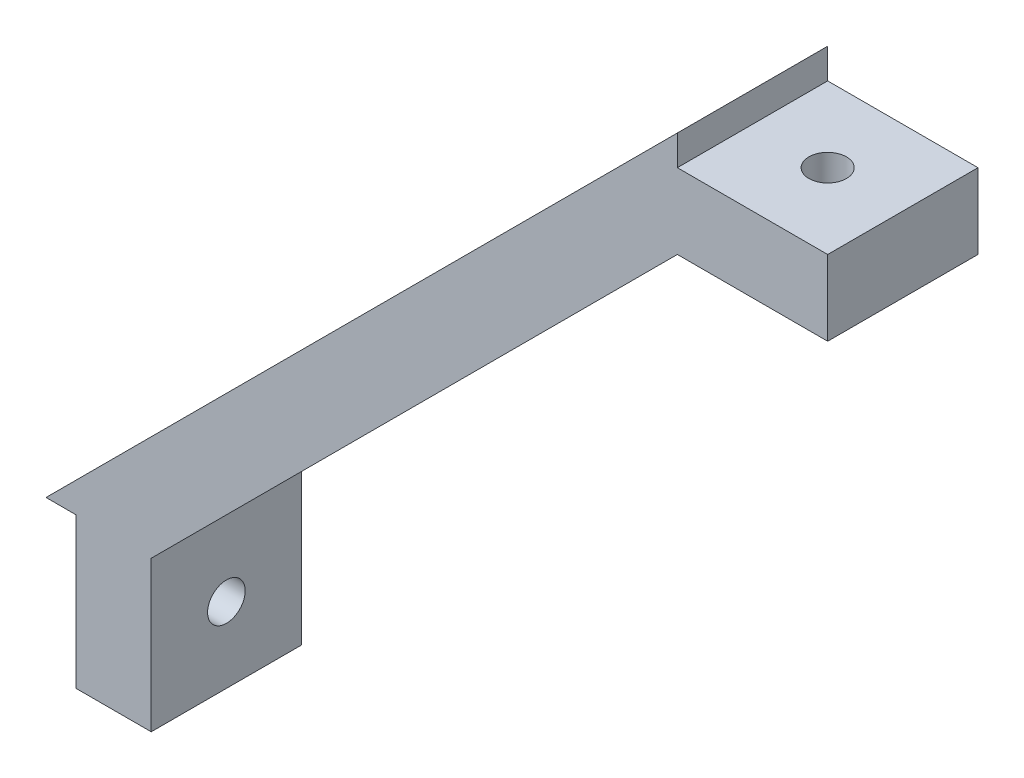
ISO-10303-21;
HEADER;
FILE_DESCRIPTION(('STEP AP214'),'2;1');
FILE_NAME('part.step','',(''),(''),'','','');
FILE_SCHEMA(('AUTOMOTIVE_DESIGN { 1 0 10303 214 1 1 1 1 }'));
ENDSEC;
DATA;
#1=APPLICATION_CONTEXT('core data for automotive mechanical design processes');
#2=APPLICATION_PROTOCOL_DEFINITION('international standard','automotive_design',2000,#1);
#3=PRODUCT_CONTEXT('',#1,'mechanical');
#4=PRODUCT('Part','Part','',(#3));
#5=PRODUCT_RELATED_PRODUCT_CATEGORY('part','',(#4));
#6=PRODUCT_DEFINITION_FORMATION('','',#4);
#7=PRODUCT_DEFINITION_CONTEXT('part definition',#1,'design');
#8=PRODUCT_DEFINITION('design','',#6,#7);
#9=PRODUCT_DEFINITION_SHAPE('','',#8);
#10=(LENGTH_UNIT() NAMED_UNIT(*) SI_UNIT(.MILLI.,.METRE.));
#11=(NAMED_UNIT(*) PLANE_ANGLE_UNIT() SI_UNIT($,.RADIAN.));
#12=(NAMED_UNIT(*) SI_UNIT($,.STERADIAN.) SOLID_ANGLE_UNIT());
#13=UNCERTAINTY_MEASURE_WITH_UNIT(LENGTH_MEASURE(1.E-05),#10,'distance_accuracy_value','');
#14=(GEOMETRIC_REPRESENTATION_CONTEXT(3) GLOBAL_UNCERTAINTY_ASSIGNED_CONTEXT((#13)) GLOBAL_UNIT_ASSIGNED_CONTEXT((#10,
#11,#12)) REPRESENTATION_CONTEXT('',''));
#15=CARTESIAN_POINT('',(0.,0.,0.));
#16=DIRECTION('',(0.,0.,1.));
#17=DIRECTION('',(1.,0.,0.));
#18=AXIS2_PLACEMENT_3D('',#15,#16,#17);
#19=CARTESIAN_POINT('',(-35.142135623731,6.85786437626901,0.));
#20=DIRECTION('',(0.707106781186549,-0.707106781186546,0.));
#21=DIRECTION('',(0.707106781186546,0.707106781186549,0.));
#22=AXIS2_PLACEMENT_3D('',#19,#20,#21);
#23=CYLINDRICAL_SURFACE('',#22,1.25);
#24=CARTESIAN_POINT('',(-10.6421356237309,-17.642135623731,0.));
#25=DIRECTION('',(-0.707106781186549,0.707106781186546,0.));
#26=DIRECTION('',(-0.707106781186546,-0.707106781186549,0.));
#27=AXIS2_PLACEMENT_3D('',#24,#25,#26);
#28=CIRCLE('',#27,1.25);
#29=CARTESIAN_POINT('',(-11.5260191002141,-18.5260191002142,0.));
#30=VERTEX_POINT('',#29);
#31=EDGE_CURVE('E43',#30,#30,#28,.T.);
#32=ORIENTED_EDGE('',*,*,#31,.F.);
#33=EDGE_LOOP('',(#32));
#34=FACE_BOUND('',#33,.T.);
#35=CARTESIAN_POINT('',(-14.1421356237309,-14.142135623731,0.));
#36=DIRECTION('',(0.707106781186549,-0.707106781186546,0.));
#37=DIRECTION('',(0.707106781186546,0.707106781186549,0.));
#38=AXIS2_PLACEMENT_3D('',#35,#36,#37);
#39=CIRCLE('',#38,1.25);
#40=CARTESIAN_POINT('',(-13.2582521472477,-13.2582521472478,0.));
#41=VERTEX_POINT('',#40);
#42=EDGE_CURVE('E11',#41,#41,#39,.F.);
#43=ORIENTED_EDGE('',*,*,#42,.T.);
#44=EDGE_LOOP('',(#43));
#45=FACE_BOUND('',#44,.T.);
#46=ADVANCED_FACE('F35',(#34,#45),#23,.F.);
#47=CARTESIAN_POINT('',(-28.0710678118655,13.9289321881345,0.));
#48=DIRECTION('',(0.707106781186549,-0.707106781186546,0.));
#49=DIRECTION('',(0.707106781186546,0.707106781186549,0.));
#50=AXIS2_PLACEMENT_3D('',#47,#48,#49);
#51=CYLINDRICAL_SURFACE('',#50,1.25);
#52=CARTESIAN_POINT('',(-3.57106781186546,-10.5710678118655,0.));
#53=DIRECTION('',(-0.707106781186549,0.707106781186546,0.));
#54=DIRECTION('',(-0.707106781186546,-0.707106781186549,0.));
#55=AXIS2_PLACEMENT_3D('',#52,#53,#54);
#56=CIRCLE('',#55,1.25);
#57=CARTESIAN_POINT('',(-4.45495128834864,-11.4549512883487,0.));
#58=VERTEX_POINT('',#57);
#59=EDGE_CURVE('E201',#58,#58,#56,.T.);
#60=ORIENTED_EDGE('',*,*,#59,.F.);
#61=EDGE_LOOP('',(#60));
#62=FACE_BOUND('',#61,.T.);
#63=CARTESIAN_POINT('',(-7.07106781186546,-7.07106781186549,0.));
#64=DIRECTION('',(0.707106781186549,-0.707106781186546,0.));
#65=DIRECTION('',(0.707106781186546,0.707106781186549,0.));
#66=AXIS2_PLACEMENT_3D('',#63,#64,#65);
#67=CIRCLE('',#66,1.25);
#68=CARTESIAN_POINT('',(-6.18718433538228,-6.1871843353823,0.));
#69=VERTEX_POINT('',#68);
#70=EDGE_CURVE('E204',#69,#69,#67,.F.);
#71=ORIENTED_EDGE('',*,*,#70,.T.);
#72=EDGE_LOOP('',(#71));
#73=FACE_BOUND('',#72,.T.);
#74=ADVANCED_FACE('F213',(#62,#73),#51,.F.);
#75=CARTESIAN_POINT('',(-21.0000000000001,21.,0.));
#76=DIRECTION('',(0.707106781186549,-0.707106781186546,0.));
#77=DIRECTION('',(0.707106781186546,0.707106781186549,0.));
#78=AXIS2_PLACEMENT_3D('',#75,#76,#77);
#79=CYLINDRICAL_SURFACE('',#78,1.25);
#80=CARTESIAN_POINT('',(3.5,-3.49999999999999,0.));
#81=DIRECTION('',(-0.707106781186549,0.707106781186546,0.));
#82=DIRECTION('',(-0.707106781186546,-0.707106781186549,0.));
#83=AXIS2_PLACEMENT_3D('',#80,#81,#82);
#84=CIRCLE('',#83,1.25);
#85=CARTESIAN_POINT('',(2.61611652351682,-4.38388347648317,0.));
#86=VERTEX_POINT('',#85);
#87=EDGE_CURVE('E184',#86,#86,#84,.T.);
#88=ORIENTED_EDGE('',*,*,#87,.F.);
#89=EDGE_LOOP('',(#88));
#90=FACE_BOUND('',#89,.T.);
#91=CARTESIAN_POINT('',(0.,0.,0.));
#92=DIRECTION('',(0.707106781186549,-0.707106781186546,0.));
#93=DIRECTION('',(0.707106781186546,0.707106781186549,0.));
#94=AXIS2_PLACEMENT_3D('',#91,#92,#93);
#95=CIRCLE('',#94,1.25);
#96=CARTESIAN_POINT('',(0.883883476483178,0.88388347648319,0.));
#97=VERTEX_POINT('',#96);
#98=EDGE_CURVE('E198',#97,#97,#95,.F.);
#99=ORIENTED_EDGE('',*,*,#98,.T.);
#100=EDGE_LOOP('',(#99));
#101=FACE_BOUND('',#100,.T.);
#102=ADVANCED_FACE('F260',(#90,#101),#79,.F.);
#103=CARTESIAN_POINT('',(-21.,-21.0000000000001,5.));
#104=DIRECTION('',(0.,1.,0.));
#105=DIRECTION('',(0.,0.,1.));
#106=AXIS2_PLACEMENT_3D('',#103,#104,#105);
#107=PLANE('',#106);
#108=DIRECTION('',(1.,0.,0.));
#109=VECTOR('',#108,1.);
#110=CARTESIAN_POINT('',(-21.,-21.0000000000001,-5.));
#111=LINE('',#110,#109);
#112=CARTESIAN_POINT('',(-21.,-21.0000000000001,-5.));
#113=VERTEX_POINT('',#112);
#114=CARTESIAN_POINT('',(-19.,-21.0000000000001,-5.));
#115=VERTEX_POINT('',#114);
#116=EDGE_CURVE('E144',#113,#115,#111,.T.);
#117=ORIENTED_EDGE('',*,*,#116,.T.);
#118=DIRECTION('',(0.,0.,-1.));
#119=VECTOR('',#118,1.);
#120=CARTESIAN_POINT('',(-19.,-21.0000000000001,5.));
#121=LINE('',#120,#119);
#122=CARTESIAN_POINT('',(-19.,-21.0000000000001,5.));
#123=VERTEX_POINT('',#122);
#124=EDGE_CURVE('E182',#123,#115,#121,.T.);
#125=ORIENTED_EDGE('',*,*,#124,.F.);
#126=DIRECTION('',(1.,0.,0.));
#127=VECTOR('',#126,1.);
#128=CARTESIAN_POINT('',(-21.,-21.0000000000001,5.));
#129=LINE('',#128,#127);
#130=CARTESIAN_POINT('',(-21.,-21.0000000000001,5.));
#131=VERTEX_POINT('',#130);
#132=EDGE_CURVE('E163',#131,#123,#129,.T.);
#133=ORIENTED_EDGE('',*,*,#132,.F.);
#134=DIRECTION('',(0.,0.,-1.));
#135=VECTOR('',#134,1.);
#136=CARTESIAN_POINT('',(-21.,-21.0000000000001,5.));
#137=LINE('',#136,#135);
#138=EDGE_CURVE('E140',#131,#113,#137,.T.);
#139=ORIENTED_EDGE('',*,*,#138,.T.);
#140=EDGE_LOOP('',(#117,#125,#133,#139));
#141=FACE_BOUND('',#140,.T.);
#142=ADVANCED_FACE('F256',(#141),#107,.F.);
#143=CARTESIAN_POINT('',(-19.,-21.0000000000001,5.));
#144=DIRECTION('',(1.,0.,0.));
#145=DIRECTION('',(0.,1.,0.));
#146=AXIS2_PLACEMENT_3D('',#143,#144,#145);
#147=PLANE('',#146);
#148=CARTESIAN_POINT('',(-19.,-26.0000000000001,0.));
#149=DIRECTION('',(1.,0.,0.));
#150=DIRECTION('',(0.,1.,0.));
#151=AXIS2_PLACEMENT_3D('',#148,#149,#150);
#152=CIRCLE('',#151,1.25);
#153=CARTESIAN_POINT('',(-19.,-24.7500000000001,0.));
#154=VERTEX_POINT('',#153);
#155=EDGE_CURVE('E148',#154,#154,#152,.T.);
#156=ORIENTED_EDGE('',*,*,#155,.T.);
#157=EDGE_LOOP('',(#156));
#158=FACE_BOUND('',#157,.T.);
#159=DIRECTION('',(0.,-1.,0.));
#160=VECTOR('',#159,1.);
#161=CARTESIAN_POINT('',(-19.,-21.0000000000001,-5.));
#162=LINE('',#161,#160);
#163=CARTESIAN_POINT('',(-19.,-31.0000000000001,-5.));
#164=VERTEX_POINT('',#163);
#165=EDGE_CURVE('E147',#115,#164,#162,.T.);
#166=ORIENTED_EDGE('',*,*,#165,.T.);
#167=DIRECTION('',(0.,0.,-1.));
#168=VECTOR('',#167,1.);
#169=CARTESIAN_POINT('',(-19.,-31.0000000000001,5.));
#170=LINE('',#169,#168);
#171=CARTESIAN_POINT('',(-19.,-31.0000000000001,5.));
#172=VERTEX_POINT('',#171);
#173=EDGE_CURVE('E179',#172,#164,#170,.T.);
#174=ORIENTED_EDGE('',*,*,#173,.F.);
#175=DIRECTION('',(0.,-1.,0.));
#176=VECTOR('',#175,1.);
#177=CARTESIAN_POINT('',(-19.,-21.0000000000001,5.));
#178=LINE('',#177,#176);
#179=EDGE_CURVE('E101',#123,#172,#178,.T.);
#180=ORIENTED_EDGE('',*,*,#179,.F.);
#181=ORIENTED_EDGE('',*,*,#124,.T.);
#182=EDGE_LOOP('',(#166,#174,#180,#181));
#183=FACE_BOUND('',#182,.T.);
#184=ADVANCED_FACE('F252',(#158,#183),#147,.F.);
#185=CARTESIAN_POINT('',(-19.,-31.0000000000001,5.));
#186=DIRECTION('',(0.,1.,0.));
#187=DIRECTION('',(0.,0.,1.));
#188=AXIS2_PLACEMENT_3D('',#185,#186,#187);
#189=PLANE('',#188);
#190=DIRECTION('',(1.,0.,0.));
#191=VECTOR('',#190,1.);
#192=CARTESIAN_POINT('',(-19.,-31.0000000000001,-5.));
#193=LINE('',#192,#191);
#194=CARTESIAN_POINT('',(-14.,-31.0000000000001,-5.));
#195=VERTEX_POINT('',#194);
#196=EDGE_CURVE('E150',#164,#195,#193,.T.);
#197=ORIENTED_EDGE('',*,*,#196,.T.);
#198=DIRECTION('',(0.,0.,-1.));
#199=VECTOR('',#198,1.);
#200=CARTESIAN_POINT('',(-14.,-31.0000000000001,5.));
#201=LINE('',#200,#199);
#202=CARTESIAN_POINT('',(-14.,-31.0000000000001,5.));
#203=VERTEX_POINT('',#202);
#204=EDGE_CURVE('E176',#203,#195,#201,.T.);
#205=ORIENTED_EDGE('',*,*,#204,.F.);
#206=DIRECTION('',(1.,0.,0.));
#207=VECTOR('',#206,1.);
#208=CARTESIAN_POINT('',(-19.,-31.0000000000001,5.));
#209=LINE('',#208,#207);
#210=EDGE_CURVE('E402',#172,#203,#209,.T.);
#211=ORIENTED_EDGE('',*,*,#210,.F.);
#212=ORIENTED_EDGE('',*,*,#173,.T.);
#213=EDGE_LOOP('',(#197,#205,#211,#212));
#214=FACE_BOUND('',#213,.T.);
#215=ADVANCED_FACE('F248',(#214),#189,.F.);
#216=CARTESIAN_POINT('',(-14.,-31.0000000000001,5.));
#217=DIRECTION('',(-1.,0.,0.));
#218=DIRECTION('',(0.,-1.,0.));
#219=AXIS2_PLACEMENT_3D('',#216,#217,#218);
#220=PLANE('',#219);
#221=CARTESIAN_POINT('',(-14.,-26.0000000000001,0.));
#222=DIRECTION('',(-1.,0.,0.));
#223=DIRECTION('',(0.,-1.,0.));
#224=AXIS2_PLACEMENT_3D('',#221,#222,#223);
#225=CIRCLE('',#224,1.25);
#226=CARTESIAN_POINT('',(-14.,-27.2500000000001,0.));
#227=VERTEX_POINT('',#226);
#228=EDGE_CURVE('E185',#227,#227,#225,.T.);
#229=ORIENTED_EDGE('',*,*,#228,.T.);
#230=EDGE_LOOP('',(#229));
#231=FACE_BOUND('',#230,.T.);
#232=DIRECTION('',(0.,1.,0.));
#233=VECTOR('',#232,1.);
#234=CARTESIAN_POINT('',(-14.,-31.0000000000001,-5.));
#235=LINE('',#234,#233);
#236=CARTESIAN_POINT('',(-14.,-21.0000000000001,-5.));
#237=VERTEX_POINT('',#236);
#238=EDGE_CURVE('E152',#195,#237,#235,.T.);
#239=ORIENTED_EDGE('',*,*,#238,.T.);
#240=DIRECTION('',(0.,0.,-1.));
#241=VECTOR('',#240,1.);
#242=CARTESIAN_POINT('',(-14.,-21.0000000000001,5.));
#243=LINE('',#242,#241);
#244=CARTESIAN_POINT('',(-14.,-21.0000000000001,5.));
#245=VERTEX_POINT('',#244);
#246=EDGE_CURVE('E173',#245,#237,#243,.T.);
#247=ORIENTED_EDGE('',*,*,#246,.F.);
#248=DIRECTION('',(0.,1.,0.));
#249=VECTOR('',#248,1.);
#250=CARTESIAN_POINT('',(-14.,-31.0000000000001,5.));
#251=LINE('',#250,#249);
#252=EDGE_CURVE('E404',#203,#245,#251,.T.);
#253=ORIENTED_EDGE('',*,*,#252,.F.);
#254=ORIENTED_EDGE('',*,*,#204,.T.);
#255=EDGE_LOOP('',(#239,#247,#253,#254));
#256=FACE_BOUND('',#255,.T.);
#257=ADVANCED_FACE('F244',(#231,#256),#220,.F.);
#258=CARTESIAN_POINT('',(-14.,-21.0000000000001,5.));
#259=DIRECTION('',(-0.707106781186549,0.707106781186546,0.));
#260=DIRECTION('',(-0.707106781186546,-0.707106781186549,0.));
#261=AXIS2_PLACEMENT_3D('',#258,#259,#260);
#262=PLANE('',#261);
#263=CARTESIAN_POINT('',(10.5710678118655,3.5710678118655,0.));
#264=DIRECTION('',(-0.707106781186549,0.707106781186546,0.));
#265=DIRECTION('',(-0.707106781186546,-0.707106781186549,0.));
#266=AXIS2_PLACEMENT_3D('',#263,#264,#265);
#267=CIRCLE('',#266,1.25);
#268=CARTESIAN_POINT('',(9.68718433538228,2.68718433538232,0.));
#269=VERTEX_POINT('',#268);
#270=EDGE_CURVE('E388',#269,#269,#267,.T.);
#271=ORIENTED_EDGE('',*,*,#270,.T.);
#272=EDGE_LOOP('',(#271));
#273=FACE_BOUND('',#272,.T.);
#274=CARTESIAN_POINT('',(17.6421356237309,10.642135623731,0.));
#275=DIRECTION('',(-0.707106781186549,0.707106781186546,0.));
#276=DIRECTION('',(-0.707106781186546,-0.707106781186549,0.));
#277=AXIS2_PLACEMENT_3D('',#274,#275,#276);
#278=CIRCLE('',#277,1.25);
#279=CARTESIAN_POINT('',(16.7582521472477,9.75825214724781,0.));
#280=VERTEX_POINT('',#279);
#281=EDGE_CURVE('E195',#280,#280,#278,.T.);
#282=ORIENTED_EDGE('',*,*,#281,.T.);
#283=EDGE_LOOP('',(#282));
#284=FACE_BOUND('',#283,.T.);
#285=DIRECTION('',(0.707106781186546,0.707106781186549,0.));
#286=VECTOR('',#285,1.);
#287=CARTESIAN_POINT('',(-14.,-21.0000000000001,-5.));
#288=LINE('',#287,#286);
#289=CARTESIAN_POINT('',(21.,14.0000000000001,-5.));
#290=VERTEX_POINT('',#289);
#291=EDGE_CURVE('E154',#237,#290,#288,.T.);
#292=ORIENTED_EDGE('',*,*,#291,.T.);
#293=DIRECTION('',(0.,0.,-1.));
#294=VECTOR('',#293,1.);
#295=CARTESIAN_POINT('',(21.,14.0000000000001,5.));
#296=LINE('',#295,#294);
#297=CARTESIAN_POINT('',(21.,14.0000000000001,5.));
#298=VERTEX_POINT('',#297);
#299=EDGE_CURVE('E170',#298,#290,#296,.T.);
#300=ORIENTED_EDGE('',*,*,#299,.F.);
#301=DIRECTION('',(0.707106781186546,0.707106781186549,0.));
#302=VECTOR('',#301,1.);
#303=CARTESIAN_POINT('',(-14.,-21.0000000000001,5.));
#304=LINE('',#303,#302);
#305=EDGE_CURVE('E406',#245,#298,#304,.T.);
#306=ORIENTED_EDGE('',*,*,#305,.F.);
#307=ORIENTED_EDGE('',*,*,#246,.T.);
#308=EDGE_LOOP('',(#292,#300,#306,#307));
#309=FACE_BOUND('',#308,.T.);
#310=ORIENTED_EDGE('',*,*,#87,.T.);
#311=EDGE_LOOP('',(#310));
#312=FACE_BOUND('',#311,.T.);
#313=ORIENTED_EDGE('',*,*,#59,.T.);
#314=EDGE_LOOP('',(#313));
#315=FACE_BOUND('',#314,.T.);
#316=ORIENTED_EDGE('',*,*,#31,.T.);
#317=EDGE_LOOP('',(#316));
#318=FACE_BOUND('',#317,.T.);
#319=ADVANCED_FACE('F209',(#273,#284,#309,#312,#315,#318),#262,.F.);
#320=CARTESIAN_POINT('',(21.,14.0000000000001,5.));
#321=DIRECTION('',(0.,1.,0.));
#322=DIRECTION('',(0.,0.,1.));
#323=AXIS2_PLACEMENT_3D('',#320,#321,#322);
#324=PLANE('',#323);
#325=CARTESIAN_POINT('',(26.,14.0000000000001,0.));
#326=DIRECTION('',(0.,1.,0.));
#327=DIRECTION('',(0.,0.,1.));
#328=AXIS2_PLACEMENT_3D('',#325,#326,#327);
#329=CIRCLE('',#328,1.25);
#330=CARTESIAN_POINT('',(26.,14.0000000000001,1.25));
#331=VERTEX_POINT('',#330);
#332=EDGE_CURVE('E188',#331,#331,#329,.T.);
#333=ORIENTED_EDGE('',*,*,#332,.T.);
#334=EDGE_LOOP('',(#333));
#335=FACE_BOUND('',#334,.T.);
#336=DIRECTION('',(1.,0.,0.));
#337=VECTOR('',#336,1.);
#338=CARTESIAN_POINT('',(21.,14.0000000000001,-5.));
#339=LINE('',#338,#337);
#340=CARTESIAN_POINT('',(31.,14.0000000000001,-5.));
#341=VERTEX_POINT('',#340);
#342=EDGE_CURVE('E156',#290,#341,#339,.T.);
#343=ORIENTED_EDGE('',*,*,#342,.T.);
#344=DIRECTION('',(0.,0.,-1.));
#345=VECTOR('',#344,1.);
#346=CARTESIAN_POINT('',(31.,14.0000000000001,5.));
#347=LINE('',#346,#345);
#348=CARTESIAN_POINT('',(31.,14.0000000000001,5.));
#349=VERTEX_POINT('',#348);
#350=EDGE_CURVE('E167',#349,#341,#347,.T.);
#351=ORIENTED_EDGE('',*,*,#350,.F.);
#352=DIRECTION('',(1.,0.,0.));
#353=VECTOR('',#352,1.);
#354=CARTESIAN_POINT('',(21.,14.0000000000001,5.));
#355=LINE('',#354,#353);
#356=EDGE_CURVE('E408',#298,#349,#355,.T.);
#357=ORIENTED_EDGE('',*,*,#356,.F.);
#358=ORIENTED_EDGE('',*,*,#299,.T.);
#359=EDGE_LOOP('',(#343,#351,#357,#358));
#360=FACE_BOUND('',#359,.T.);
#361=ADVANCED_FACE('F237',(#335,#360),#324,.F.);
#362=CARTESIAN_POINT('',(31.,19.0000000000001,5.));
#363=DIRECTION('',(-1.,0.,0.));
#364=DIRECTION('',(0.,-1.,0.));
#365=AXIS2_PLACEMENT_3D('',#362,#363,#364);
#366=PLANE('',#365);
#367=DIRECTION('',(0.,1.,0.));
#368=VECTOR('',#367,1.);
#369=CARTESIAN_POINT('',(31.,19.0000000000001,-5.));
#370=LINE('',#369,#368);
#371=CARTESIAN_POINT('',(31.,19.0000000000001,-5.));
#372=VERTEX_POINT('',#371);
#373=EDGE_CURVE('E158',#341,#372,#370,.T.);
#374=ORIENTED_EDGE('',*,*,#373,.T.);
#375=DIRECTION('',(0.,0.,-1.));
#376=VECTOR('',#375,1.);
#377=CARTESIAN_POINT('',(31.,19.0000000000001,5.));
#378=LINE('',#377,#376);
#379=CARTESIAN_POINT('',(31.,19.0000000000001,5.));
#380=VERTEX_POINT('',#379);
#381=EDGE_CURVE('E135',#380,#372,#378,.T.);
#382=ORIENTED_EDGE('',*,*,#381,.F.);
#383=DIRECTION('',(0.,1.,0.));
#384=VECTOR('',#383,1.);
#385=CARTESIAN_POINT('',(31.,19.0000000000001,5.));
#386=LINE('',#385,#384);
#387=EDGE_CURVE('E126',#349,#380,#386,.T.);
#388=ORIENTED_EDGE('',*,*,#387,.F.);
#389=ORIENTED_EDGE('',*,*,#350,.T.);
#390=EDGE_LOOP('',(#374,#382,#388,#389));
#391=FACE_BOUND('',#390,.T.);
#392=ADVANCED_FACE('F233',(#391),#366,.F.);
#393=CARTESIAN_POINT('',(21.,19.0000000000001,5.));
#394=DIRECTION('',(0.,-1.,0.));
#395=DIRECTION('',(1.,0.,0.));
#396=AXIS2_PLACEMENT_3D('',#393,#394,#395);
#397=PLANE('',#396);
#398=CARTESIAN_POINT('',(26.,19.0000000000001,0.));
#399=DIRECTION('',(0.,-1.,0.));
#400=DIRECTION('',(1.,0.,0.));
#401=AXIS2_PLACEMENT_3D('',#398,#399,#400);
#402=CIRCLE('',#401,1.25);
#403=CARTESIAN_POINT('',(27.25,19.0000000000001,0.));
#404=VERTEX_POINT('',#403);
#405=EDGE_CURVE('E189',#404,#404,#402,.T.);
#406=ORIENTED_EDGE('',*,*,#405,.T.);
#407=EDGE_LOOP('',(#406));
#408=FACE_BOUND('',#407,.T.);
#409=DIRECTION('',(-1.,0.,0.));
#410=VECTOR('',#409,1.);
#411=CARTESIAN_POINT('',(21.,19.0000000000001,-5.));
#412=LINE('',#411,#410);
#413=CARTESIAN_POINT('',(21.,19.0000000000001,-5.));
#414=VERTEX_POINT('',#413);
#415=EDGE_CURVE('E134',#372,#414,#412,.T.);
#416=ORIENTED_EDGE('',*,*,#415,.T.);
#417=DIRECTION('',(0.,0.,-1.));
#418=VECTOR('',#417,1.);
#419=CARTESIAN_POINT('',(21.,19.0000000000001,5.));
#420=LINE('',#419,#418);
#421=CARTESIAN_POINT('',(21.,19.0000000000001,5.));
#422=VERTEX_POINT('',#421);
#423=EDGE_CURVE('E131',#422,#414,#420,.T.);
#424=ORIENTED_EDGE('',*,*,#423,.F.);
#425=DIRECTION('',(-1.,0.,0.));
#426=VECTOR('',#425,1.);
#427=CARTESIAN_POINT('',(21.,19.0000000000001,5.));
#428=LINE('',#427,#426);
#429=EDGE_CURVE('E120',#380,#422,#428,.T.);
#430=ORIENTED_EDGE('',*,*,#429,.F.);
#431=ORIENTED_EDGE('',*,*,#381,.T.);
#432=EDGE_LOOP('',(#416,#424,#430,#431));
#433=FACE_BOUND('',#432,.T.);
#434=ADVANCED_FACE('F132',(#408,#433),#397,.F.);
#435=CARTESIAN_POINT('',(21.,21.0000000000001,5.));
#436=DIRECTION('',(-1.,0.,0.));
#437=DIRECTION('',(0.,0.,1.));
#438=AXIS2_PLACEMENT_3D('',#435,#436,#437);
#439=PLANE('',#438);
#440=DIRECTION('',(0.,1.,0.));
#441=VECTOR('',#440,1.);
#442=CARTESIAN_POINT('',(21.,21.0000000000001,-5.));
#443=LINE('',#442,#441);
#444=CARTESIAN_POINT('',(21.,21.0000000000001,-5.));
#445=VERTEX_POINT('',#444);
#446=EDGE_CURVE('E86',#414,#445,#443,.T.);
#447=ORIENTED_EDGE('',*,*,#446,.T.);
#448=DIRECTION('',(0.,0.,-1.));
#449=VECTOR('',#448,1.);
#450=CARTESIAN_POINT('',(21.,21.0000000000001,5.));
#451=LINE('',#450,#449);
#452=CARTESIAN_POINT('',(21.,21.0000000000001,5.));
#453=VERTEX_POINT('',#452);
#454=EDGE_CURVE('E136',#453,#445,#451,.T.);
#455=ORIENTED_EDGE('',*,*,#454,.F.);
#456=DIRECTION('',(0.,1.,0.));
#457=VECTOR('',#456,1.);
#458=CARTESIAN_POINT('',(21.,21.0000000000001,5.));
#459=LINE('',#458,#457);
#460=EDGE_CURVE('E124',#422,#453,#459,.T.);
#461=ORIENTED_EDGE('',*,*,#460,.F.);
#462=ORIENTED_EDGE('',*,*,#423,.T.);
#463=EDGE_LOOP('',(#447,#455,#461,#462));
#464=FACE_BOUND('',#463,.T.);
#465=ADVANCED_FACE('F138',(#464),#439,.F.);
#466=CARTESIAN_POINT('',(-21.,-21.0000000000001,5.));
#467=DIRECTION('',(0.707106781186549,-0.707106781186546,0.));
#468=DIRECTION('',(0.707106781186546,0.707106781186549,0.));
#469=AXIS2_PLACEMENT_3D('',#466,#467,#468);
#470=PLANE('',#469);
#471=CARTESIAN_POINT('',(7.07106781186546,7.07106781186549,0.));
#472=DIRECTION('',(0.707106781186549,-0.707106781186546,0.));
#473=DIRECTION('',(0.707106781186546,0.707106781186549,0.));
#474=AXIS2_PLACEMENT_3D('',#471,#472,#473);
#475=CIRCLE('',#474,1.25);
#476=CARTESIAN_POINT('',(7.95495128834864,7.95495128834868,0.));
#477=VERTEX_POINT('',#476);
#478=EDGE_CURVE('E390',#477,#477,#475,.F.);
#479=ORIENTED_EDGE('',*,*,#478,.F.);
#480=EDGE_LOOP('',(#479));
#481=FACE_BOUND('',#480,.T.);
#482=CARTESIAN_POINT('',(14.1421356237309,14.142135623731,0.));
#483=DIRECTION('',(0.707106781186549,-0.707106781186546,0.));
#484=DIRECTION('',(0.707106781186546,0.707106781186549,0.));
#485=AXIS2_PLACEMENT_3D('',#482,#483,#484);
#486=CIRCLE('',#485,1.25);
#487=CARTESIAN_POINT('',(15.0260191002141,15.0260191002142,0.));
#488=VERTEX_POINT('',#487);
#489=EDGE_CURVE('E192',#488,#488,#486,.F.);
#490=ORIENTED_EDGE('',*,*,#489,.F.);
#491=EDGE_LOOP('',(#490));
#492=FACE_BOUND('',#491,.T.);
#493=DIRECTION('',(-0.707106781186546,-0.707106781186549,0.));
#494=VECTOR('',#493,1.);
#495=CARTESIAN_POINT('',(-21.,-21.0000000000001,-5.));
#496=LINE('',#495,#494);
#497=EDGE_CURVE('E92',#445,#113,#496,.T.);
#498=ORIENTED_EDGE('',*,*,#497,.T.);
#499=ORIENTED_EDGE('',*,*,#138,.F.);
#500=DIRECTION('',(-0.707106781186546,-0.707106781186549,0.));
#501=VECTOR('',#500,1.);
#502=CARTESIAN_POINT('',(-21.,-21.0000000000001,5.));
#503=LINE('',#502,#501);
#504=EDGE_CURVE('E51',#453,#131,#503,.T.);
#505=ORIENTED_EDGE('',*,*,#504,.F.);
#506=ORIENTED_EDGE('',*,*,#454,.T.);
#507=EDGE_LOOP('',(#498,#499,#505,#506));
#508=FACE_BOUND('',#507,.T.);
#509=ORIENTED_EDGE('',*,*,#98,.F.);
#510=EDGE_LOOP('',(#509));
#511=FACE_BOUND('',#510,.T.);
#512=ORIENTED_EDGE('',*,*,#70,.F.);
#513=EDGE_LOOP('',(#512));
#514=FACE_BOUND('',#513,.T.);
#515=ORIENTED_EDGE('',*,*,#42,.F.);
#516=EDGE_LOOP('',(#515));
#517=FACE_BOUND('',#516,.T.);
#518=ADVANCED_FACE('F216',(#481,#492,#508,#511,#514,#517),#470,.F.);
#519=CARTESIAN_POINT('',(0.,0.,5.));
#520=DIRECTION('',(0.,0.,-1.));
#521=DIRECTION('',(-1.,0.,0.));
#522=AXIS2_PLACEMENT_3D('',#519,#520,#521);
#523=PLANE('',#522);
#524=ORIENTED_EDGE('',*,*,#132,.T.);
#525=ORIENTED_EDGE('',*,*,#179,.T.);
#526=ORIENTED_EDGE('',*,*,#210,.T.);
#527=ORIENTED_EDGE('',*,*,#252,.T.);
#528=ORIENTED_EDGE('',*,*,#305,.T.);
#529=ORIENTED_EDGE('',*,*,#356,.T.);
#530=ORIENTED_EDGE('',*,*,#387,.T.);
#531=ORIENTED_EDGE('',*,*,#429,.T.);
#532=ORIENTED_EDGE('',*,*,#460,.T.);
#533=ORIENTED_EDGE('',*,*,#504,.T.);
#534=EDGE_LOOP('',(#524,#525,#526,#527,#528,#529,#530,#531,#532,#533));
#535=FACE_BOUND('',#534,.T.);
#536=ADVANCED_FACE('F122',(#535),#523,.F.);
#537=CARTESIAN_POINT('',(0.,0.,-5.));
#538=DIRECTION('',(0.,0.,-1.));
#539=DIRECTION('',(-1.,0.,0.));
#540=AXIS2_PLACEMENT_3D('',#537,#538,#539);
#541=PLANE('',#540);
#542=ORIENTED_EDGE('',*,*,#116,.F.);
#543=ORIENTED_EDGE('',*,*,#497,.F.);
#544=ORIENTED_EDGE('',*,*,#446,.F.);
#545=ORIENTED_EDGE('',*,*,#415,.F.);
#546=ORIENTED_EDGE('',*,*,#373,.F.);
#547=ORIENTED_EDGE('',*,*,#342,.F.);
#548=ORIENTED_EDGE('',*,*,#291,.F.);
#549=ORIENTED_EDGE('',*,*,#238,.F.);
#550=ORIENTED_EDGE('',*,*,#196,.F.);
#551=ORIENTED_EDGE('',*,*,#165,.F.);
#552=EDGE_LOOP('',(#542,#543,#544,#545,#546,#547,#548,#549,#550,#551));
#553=FACE_BOUND('',#552,.T.);
#554=ADVANCED_FACE('F224',(#553),#541,.T.);
#555=CARTESIAN_POINT('',(-21.,-26.0000000000001,0.));
#556=DIRECTION('',(1.,0.,0.));
#557=DIRECTION('',(0.,1.,0.));
#558=AXIS2_PLACEMENT_3D('',#555,#556,#557);
#559=CYLINDRICAL_SURFACE('',#558,1.25);
#560=ORIENTED_EDGE('',*,*,#228,.F.);
#561=EDGE_LOOP('',(#560));
#562=FACE_BOUND('',#561,.T.);
#563=ORIENTED_EDGE('',*,*,#155,.F.);
#564=EDGE_LOOP('',(#563));
#565=FACE_BOUND('',#564,.T.);
#566=ADVANCED_FACE('F332',(#562,#565),#559,.F.);
#567=CARTESIAN_POINT('',(26.,21.0000000000001,0.));
#568=DIRECTION('',(0.,-1.,0.));
#569=DIRECTION('',(0.,0.,-1.));
#570=AXIS2_PLACEMENT_3D('',#567,#568,#569);
#571=CYLINDRICAL_SURFACE('',#570,1.25);
#572=ORIENTED_EDGE('',*,*,#405,.F.);
#573=EDGE_LOOP('',(#572));
#574=FACE_BOUND('',#573,.T.);
#575=ORIENTED_EDGE('',*,*,#332,.F.);
#576=EDGE_LOOP('',(#575));
#577=FACE_BOUND('',#576,.T.);
#578=ADVANCED_FACE('F341',(#574,#577),#571,.F.);
#579=CARTESIAN_POINT('',(-6.85786437626915,35.142135623731,0.));
#580=DIRECTION('',(0.707106781186549,-0.707106781186546,0.));
#581=DIRECTION('',(0.707106781186546,0.707106781186549,0.));
#582=AXIS2_PLACEMENT_3D('',#579,#580,#581);
#583=CYLINDRICAL_SURFACE('',#582,1.25);
#584=ORIENTED_EDGE('',*,*,#281,.F.);
#585=EDGE_LOOP('',(#584));
#586=FACE_BOUND('',#585,.T.);
#587=ORIENTED_EDGE('',*,*,#489,.T.);
#588=EDGE_LOOP('',(#587));
#589=FACE_BOUND('',#588,.T.);
#590=ADVANCED_FACE('F347',(#586,#589),#583,.F.);
#591=CARTESIAN_POINT('',(-13.9289321881346,28.0710678118655,0.));
#592=DIRECTION('',(0.707106781186549,-0.707106781186546,0.));
#593=DIRECTION('',(0.707106781186546,0.707106781186549,0.));
#594=AXIS2_PLACEMENT_3D('',#591,#592,#593);
#595=CYLINDRICAL_SURFACE('',#594,1.25);
#596=ORIENTED_EDGE('',*,*,#270,.F.);
#597=EDGE_LOOP('',(#596));
#598=FACE_BOUND('',#597,.T.);
#599=ORIENTED_EDGE('',*,*,#478,.T.);
#600=EDGE_LOOP('',(#599));
#601=FACE_BOUND('',#600,.T.);
#602=ADVANCED_FACE('F355',(#598,#601),#595,.F.);
#603=CLOSED_SHELL('',(#46,#74,#102,#142,#184,#215,#257,#319,#361,#392,#434,#465,#518,#536,#554,
#566,#578,#590,#602));
#604=MANIFOLD_SOLID_BREP('B2',#603);
#605=ADVANCED_BREP_SHAPE_REPRESENTATION('',(#18,#604),#14);
#606=SHAPE_DEFINITION_REPRESENTATION(#9,#605);
ENDSEC;
END-ISO-10303-21;
